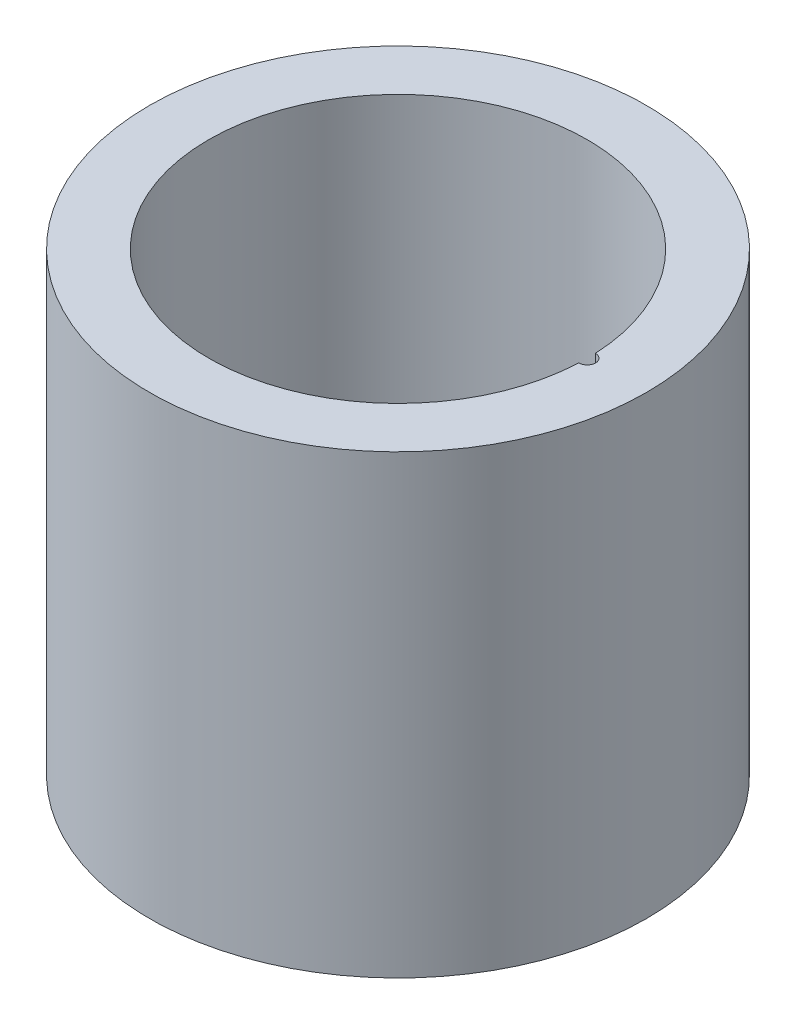
ISO-10303-21;
HEADER;
FILE_DESCRIPTION(('STEP AP214'),'2;1');
FILE_NAME('part.step','',(''),(''),'','','');
FILE_SCHEMA(('AUTOMOTIVE_DESIGN { 1 0 10303 214 1 1 1 1 }'));
ENDSEC;
DATA;
#1=APPLICATION_CONTEXT('core data for automotive mechanical design processes');
#2=APPLICATION_PROTOCOL_DEFINITION('international standard','automotive_design',2000,#1);
#3=PRODUCT_CONTEXT('',#1,'mechanical');
#4=PRODUCT('Part','Part','',(#3));
#5=PRODUCT_RELATED_PRODUCT_CATEGORY('part','',(#4));
#6=PRODUCT_DEFINITION_FORMATION('','',#4);
#7=PRODUCT_DEFINITION_CONTEXT('part definition',#1,'design');
#8=PRODUCT_DEFINITION('design','',#6,#7);
#9=PRODUCT_DEFINITION_SHAPE('','',#8);
#10=(LENGTH_UNIT() NAMED_UNIT(*) SI_UNIT(.MILLI.,.METRE.));
#11=(NAMED_UNIT(*) PLANE_ANGLE_UNIT() SI_UNIT($,.RADIAN.));
#12=(NAMED_UNIT(*) SI_UNIT($,.STERADIAN.) SOLID_ANGLE_UNIT());
#13=UNCERTAINTY_MEASURE_WITH_UNIT(LENGTH_MEASURE(1.E-05),#10,'distance_accuracy_value','');
#14=(GEOMETRIC_REPRESENTATION_CONTEXT(3) GLOBAL_UNCERTAINTY_ASSIGNED_CONTEXT((#13)) GLOBAL_UNIT_ASSIGNED_CONTEXT((#10,
#11,#12)) REPRESENTATION_CONTEXT('',''));
#15=CARTESIAN_POINT('',(0.,0.,0.));
#16=DIRECTION('',(0.,0.,1.));
#17=DIRECTION('',(1.,0.,0.));
#18=AXIS2_PLACEMENT_3D('',#15,#16,#17);
#19=CARTESIAN_POINT('',(0.,0.,0.));
#20=DIRECTION('',(0.,-1.,0.));
#21=DIRECTION('',(1.,0.,0.));
#22=AXIS2_PLACEMENT_3D('',#19,#20,#21);
#23=PLANE('',#22);
#24=CARTESIAN_POINT('',(0.,0.,0.));
#25=DIRECTION('',(0.,-1.,0.));
#26=DIRECTION('',(1.,0.,0.));
#27=AXIS2_PLACEMENT_3D('',#24,#25,#26);
#28=CIRCLE('',#27,30.);
#29=CARTESIAN_POINT('',(30.,1.02907469966573E-13,0.));
#30=VERTEX_POINT('',#29);
#31=EDGE_CURVE('E11',#30,#30,#28,.T.);
#32=ORIENTED_EDGE('',*,*,#31,.T.);
#33=EDGE_LOOP('',(#32));
#34=FACE_BOUND('',#33,.T.);
#35=ADVANCED_FACE('F39',(#34),#23,.T.);
#36=CARTESIAN_POINT('',(3.77338949215132E-12,-1100.03369824669,0.));
#37=DIRECTION('',(0.,-1.,0.));
#38=DIRECTION('',(1.,0.,0.));
#39=AXIS2_PLACEMENT_3D('',#36,#37,#38);
#40=CYLINDRICAL_SURFACE('',#39,30.0000000000001);
#41=CARTESIAN_POINT('',(-1.88663694938718E-13,54.9999999999999,0.));
#42=DIRECTION('',(0.,-1.,0.));
#43=DIRECTION('',(1.,0.,0.));
#44=AXIS2_PLACEMENT_3D('',#41,#42,#43);
#45=CIRCLE('',#44,30.0000000000002);
#46=CARTESIAN_POINT('',(30.,55.,0.));
#47=VERTEX_POINT('',#46);
#48=EDGE_CURVE('E46',#47,#47,#45,.T.);
#49=ORIENTED_EDGE('',*,*,#48,.T.);
#50=EDGE_LOOP('',(#49));
#51=FACE_BOUND('',#50,.T.);
#52=ORIENTED_EDGE('',*,*,#31,.F.);
#53=EDGE_LOOP('',(#52));
#54=FACE_BOUND('',#53,.T.);
#55=ADVANCED_FACE('F94',(#51,#54),#40,.T.);
#56=CARTESIAN_POINT('',(30.,55.,0.));
#57=DIRECTION('',(0.,1.,0.));
#58=DIRECTION('',(-1.,0.,0.));
#59=AXIS2_PLACEMENT_3D('',#56,#57,#58);
#60=PLANE('',#59);
#61=CARTESIAN_POINT('',(22.8476821192053,55.,0.));
#62=DIRECTION('',(0.,1.,0.));
#63=DIRECTION('',(-1.,0.,0.));
#64=AXIS2_PLACEMENT_3D('',#61,#62,#63);
#65=CIRCLE('',#64,1.);
#66=CARTESIAN_POINT('',(22.8257980612342,55.,0.999760515326906));
#67=VERTEX_POINT('',#66);
#68=CARTESIAN_POINT('',(22.8257980612342,55.,-0.999760515326906));
#69=VERTEX_POINT('',#68);
#70=EDGE_CURVE('E58',#67,#69,#65,.T.);
#71=ORIENTED_EDGE('',*,*,#70,.F.);
#72=CARTESIAN_POINT('',(-1.88663694938718E-13,54.9999999999999,0.));
#73=DIRECTION('',(0.,-1.,0.));
#74=DIRECTION('',(1.,0.,0.));
#75=AXIS2_PLACEMENT_3D('',#72,#73,#74);
#76=CIRCLE('',#75,22.8476821192055);
#77=EDGE_CURVE('E81',#67,#69,#76,.T.);
#78=ORIENTED_EDGE('',*,*,#77,.T.);
#79=EDGE_LOOP('',(#71,#78));
#80=FACE_BOUND('',#79,.T.);
#81=ORIENTED_EDGE('',*,*,#48,.F.);
#82=EDGE_LOOP('',(#81));
#83=FACE_BOUND('',#82,.T.);
#84=ADVANCED_FACE('F97',(#80,#83),#60,.T.);
#85=CARTESIAN_POINT('',(3.77338949215132E-12,-1100.03369824669,0.));
#86=DIRECTION('',(0.,-1.,0.));
#87=DIRECTION('',(1.,0.,0.));
#88=AXIS2_PLACEMENT_3D('',#85,#86,#87);
#89=CYLINDRICAL_SURFACE('',#88,22.8476821192054);
#90=DIRECTION('',(0.,1.,0.));
#91=VECTOR('',#90,1.);
#92=CARTESIAN_POINT('',(22.8257980612343,35.,0.999760515326906));
#93=LINE('',#92,#91);
#94=CARTESIAN_POINT('',(22.8257980612343,15.,0.999760515326905));
#95=VERTEX_POINT('',#94);
#96=EDGE_CURVE('E69',#95,#67,#93,.T.);
#97=ORIENTED_EDGE('',*,*,#96,.F.);
#98=CARTESIAN_POINT('',(0.,14.9999999999999,0.));
#99=DIRECTION('',(0.,-1.,0.));
#100=DIRECTION('',(1.,0.,0.));
#101=AXIS2_PLACEMENT_3D('',#98,#99,#100);
#102=CIRCLE('',#101,22.8476821192053);
#103=CARTESIAN_POINT('',(22.8257980612343,15.,-0.999760515326969));
#104=VERTEX_POINT('',#103);
#105=EDGE_CURVE('E79',#95,#104,#102,.T.);
#106=ORIENTED_EDGE('',*,*,#105,.T.);
#107=DIRECTION('',(0.,1.,0.));
#108=VECTOR('',#107,1.);
#109=CARTESIAN_POINT('',(22.8257980612343,35.,-0.999760515326906));
#110=LINE('',#109,#108);
#111=EDGE_CURVE('E53',#69,#104,#110,.F.);
#112=ORIENTED_EDGE('',*,*,#111,.F.);
#113=ORIENTED_EDGE('',*,*,#77,.F.);
#114=EDGE_LOOP('',(#97,#106,#112,#113));
#115=FACE_BOUND('',#114,.T.);
#116=ADVANCED_FACE('F78',(#115),#89,.F.);
#117=CARTESIAN_POINT('',(23.8476821192053,15.,0.));
#118=DIRECTION('',(0.,-1.,0.));
#119=DIRECTION('',(1.,0.,0.));
#120=AXIS2_PLACEMENT_3D('',#117,#118,#119);
#121=PLANE('',#120);
#122=CARTESIAN_POINT('',(22.8476821192054,15.,0.));
#123=DIRECTION('',(0.,1.,0.));
#124=DIRECTION('',(-1.,0.,0.));
#125=AXIS2_PLACEMENT_3D('',#122,#123,#124);
#126=CIRCLE('',#125,1.);
#127=CARTESIAN_POINT('',(23.8476821192054,15.,0.));
#128=VERTEX_POINT('',#127);
#129=EDGE_CURVE('E66',#95,#128,#126,.T.);
#130=ORIENTED_EDGE('',*,*,#129,.T.);
#131=CARTESIAN_POINT('',(0.,14.9999999999999,0.));
#132=DIRECTION('',(0.,-1.,0.));
#133=DIRECTION('',(1.,0.,0.));
#134=AXIS2_PLACEMENT_3D('',#131,#132,#133);
#135=CIRCLE('',#134,23.8476821192053);
#136=EDGE_CURVE('E85',#128,#128,#135,.T.);
#137=ORIENTED_EDGE('',*,*,#136,.T.);
#138=EDGE_CURVE('E70',#128,#104,#126,.T.);
#139=ORIENTED_EDGE('',*,*,#138,.T.);
#140=ORIENTED_EDGE('',*,*,#105,.F.);
#141=EDGE_LOOP('',(#130,#137,#139,#140));
#142=FACE_BOUND('',#141,.T.);
#143=ADVANCED_FACE('F84',(#142),#121,.T.);
#144=CARTESIAN_POINT('',(3.77338949215132E-12,-1100.03369824669,0.));
#145=DIRECTION('',(0.,-1.,0.));
#146=DIRECTION('',(1.,0.,0.));
#147=AXIS2_PLACEMENT_3D('',#144,#145,#146);
#148=CYLINDRICAL_SURFACE('',#147,23.8476821192053);
#149=CARTESIAN_POINT('',(0.,10.,0.));
#150=DIRECTION('',(0.,-1.,0.));
#151=DIRECTION('',(1.,0.,0.));
#152=AXIS2_PLACEMENT_3D('',#149,#150,#151);
#153=CIRCLE('',#152,23.8476821192053);
#154=CARTESIAN_POINT('',(23.8476821192053,10.0000000000001,0.));
#155=VERTEX_POINT('',#154);
#156=EDGE_CURVE('E88',#155,#155,#153,.T.);
#157=ORIENTED_EDGE('',*,*,#156,.T.);
#158=EDGE_LOOP('',(#157));
#159=FACE_BOUND('',#158,.T.);
#160=ORIENTED_EDGE('',*,*,#136,.F.);
#161=EDGE_LOOP('',(#160));
#162=FACE_BOUND('',#161,.T.);
#163=ADVANCED_FACE('F126',(#159,#162),#148,.F.);
#164=CARTESIAN_POINT('',(22.8476821192053,10.,0.));
#165=DIRECTION('',(0.,1.,0.));
#166=DIRECTION('',(-1.,0.,0.));
#167=AXIS2_PLACEMENT_3D('',#164,#165,#166);
#168=PLANE('',#167);
#169=CARTESIAN_POINT('',(0.,10.,0.));
#170=DIRECTION('',(0.,-1.,0.));
#171=DIRECTION('',(1.,0.,0.));
#172=AXIS2_PLACEMENT_3D('',#169,#170,#171);
#173=CIRCLE('',#172,22.8476821192054);
#174=CARTESIAN_POINT('',(22.8476821192053,10.0000000000001,0.));
#175=VERTEX_POINT('',#174);
#176=EDGE_CURVE('E192',#175,#175,#173,.T.);
#177=ORIENTED_EDGE('',*,*,#176,.T.);
#178=EDGE_LOOP('',(#177));
#179=FACE_BOUND('',#178,.T.);
#180=ORIENTED_EDGE('',*,*,#156,.F.);
#181=EDGE_LOOP('',(#180));
#182=FACE_BOUND('',#181,.T.);
#183=ADVANCED_FACE('F121',(#179,#182),#168,.T.);
#184=CARTESIAN_POINT('',(3.77338949215132E-12,-1100.03369824669,0.));
#185=DIRECTION('',(0.,-1.,0.));
#186=DIRECTION('',(1.,0.,0.));
#187=AXIS2_PLACEMENT_3D('',#184,#185,#186);
#188=CYLINDRICAL_SURFACE('',#187,22.8476821192053);
#189=CARTESIAN_POINT('',(0.,4.99999999999989,0.));
#190=DIRECTION('',(0.,-1.,0.));
#191=DIRECTION('',(1.,0.,0.));
#192=AXIS2_PLACEMENT_3D('',#189,#190,#191);
#193=CIRCLE('',#192,22.8476821192053);
#194=CARTESIAN_POINT('',(22.8476821192053,4.99999999999997,0.));
#195=VERTEX_POINT('',#194);
#196=EDGE_CURVE('E82',#195,#195,#193,.T.);
#197=ORIENTED_EDGE('',*,*,#196,.T.);
#198=EDGE_LOOP('',(#197));
#199=FACE_BOUND('',#198,.T.);
#200=ORIENTED_EDGE('',*,*,#176,.F.);
#201=EDGE_LOOP('',(#200));
#202=FACE_BOUND('',#201,.T.);
#203=ADVANCED_FACE('F125',(#199,#202),#188,.F.);
#204=CARTESIAN_POINT('',(22.8476821192053,5.00000000000004,0.));
#205=DIRECTION('',(0.,1.,0.));
#206=DIRECTION('',(-1.,0.,0.));
#207=AXIS2_PLACEMENT_3D('',#204,#205,#206);
#208=PLANE('',#207);
#209=ORIENTED_EDGE('',*,*,#196,.F.);
#210=EDGE_LOOP('',(#209));
#211=FACE_BOUND('',#210,.T.);
#212=ADVANCED_FACE('F135',(#211),#208,.T.);
#213=CARTESIAN_POINT('',(22.8476821192054,15.,0.));
#214=DIRECTION('',(0.,1.,0.));
#215=DIRECTION('',(-1.,0.,0.));
#216=AXIS2_PLACEMENT_3D('',#213,#214,#215);
#217=CYLINDRICAL_SURFACE('',#216,1.);
#218=ORIENTED_EDGE('',*,*,#96,.T.);
#219=ORIENTED_EDGE('',*,*,#70,.T.);
#220=ORIENTED_EDGE('',*,*,#111,.T.);
#221=ORIENTED_EDGE('',*,*,#138,.F.);
#222=ORIENTED_EDGE('',*,*,#129,.F.);
#223=EDGE_LOOP('',(#218,#219,#220,#221,#222));
#224=FACE_BOUND('',#223,.T.);
#225=ADVANCED_FACE('F68',(#224),#217,.F.);
#226=CLOSED_SHELL('',(#35,#55,#84,#116,#143,#163,#183,#203,#212,#225));
#227=MANIFOLD_SOLID_BREP('B2',#226);
#228=ADVANCED_BREP_SHAPE_REPRESENTATION('',(#18,#227),#14);
#229=SHAPE_DEFINITION_REPRESENTATION(#9,#228);
ENDSEC;
END-ISO-10303-21;
